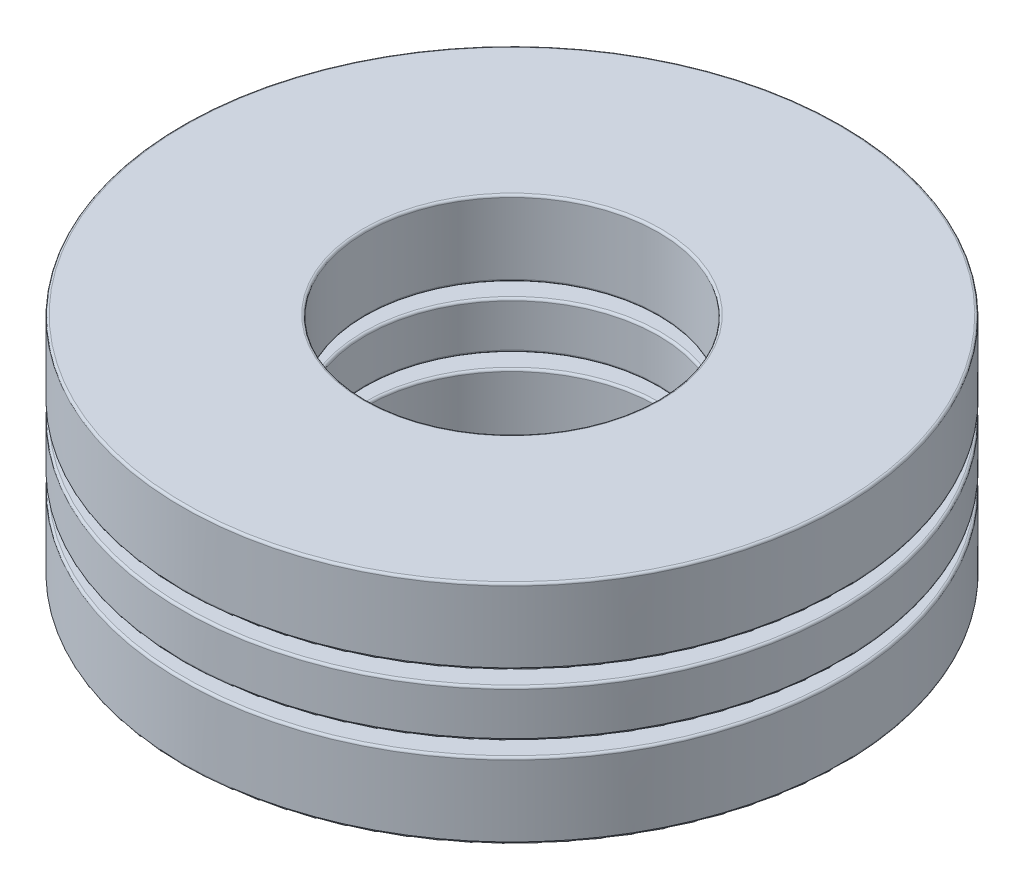
ISO-10303-21;
HEADER;
FILE_DESCRIPTION(('STEP AP214'),'2;1');
FILE_NAME('part.step','',(''),(''),'','','');
FILE_SCHEMA(('AUTOMOTIVE_DESIGN { 1 0 10303 214 1 1 1 1 }'));
ENDSEC;
DATA;
#1=APPLICATION_CONTEXT('core data for automotive mechanical design processes');
#2=APPLICATION_PROTOCOL_DEFINITION('international standard','automotive_design',2000,#1);
#3=PRODUCT_CONTEXT('',#1,'mechanical');
#4=PRODUCT('Part','Part','',(#3));
#5=PRODUCT_RELATED_PRODUCT_CATEGORY('part','',(#4));
#6=PRODUCT_DEFINITION_FORMATION('','',#4);
#7=PRODUCT_DEFINITION_CONTEXT('part definition',#1,'design');
#8=PRODUCT_DEFINITION('design','',#6,#7);
#9=PRODUCT_DEFINITION_SHAPE('','',#8);
#10=(LENGTH_UNIT() NAMED_UNIT(*) SI_UNIT(.MILLI.,.METRE.));
#11=(NAMED_UNIT(*) PLANE_ANGLE_UNIT() SI_UNIT($,.RADIAN.));
#12=(NAMED_UNIT(*) SI_UNIT($,.STERADIAN.) SOLID_ANGLE_UNIT());
#13=UNCERTAINTY_MEASURE_WITH_UNIT(LENGTH_MEASURE(1.E-05),#10,'distance_accuracy_value','');
#14=(GEOMETRIC_REPRESENTATION_CONTEXT(3) GLOBAL_UNCERTAINTY_ASSIGNED_CONTEXT((#13)) GLOBAL_UNIT_ASSIGNED_CONTEXT((#10,
#11,#12)) REPRESENTATION_CONTEXT('',''));
#15=CARTESIAN_POINT('',(0.,0.,0.));
#16=DIRECTION('',(0.,0.,1.));
#17=DIRECTION('',(1.,0.,0.));
#18=AXIS2_PLACEMENT_3D('',#15,#16,#17);
#19=CARTESIAN_POINT('',(0.,-2.4511,0.));
#20=DIRECTION('',(0.,-1.,0.));
#21=DIRECTION('',(0.,0.,-1.));
#22=AXIS2_PLACEMENT_3D('',#19,#20,#21);
#23=CYLINDRICAL_SURFACE('',#22,7.14375);
#24=CARTESIAN_POINT('',(0.,-2.402078,0.));
#25=DIRECTION('',(0.,1.,0.));
#26=DIRECTION('',(0.,0.,1.));
#27=AXIS2_PLACEMENT_3D('',#24,#25,#26);
#28=CIRCLE('',#27,7.14375);
#29=CARTESIAN_POINT('',(0.,-2.402078,7.14375));
#30=VERTEX_POINT('',#29);
#31=EDGE_CURVE('E11',#30,#30,#28,.T.);
#32=ORIENTED_EDGE('',*,*,#31,.T.);
#33=EDGE_LOOP('',(#32));
#34=FACE_BOUND('',#33,.T.);
#35=CARTESIAN_POINT('',(0.,-0.866055333333331,0.));
#36=DIRECTION('',(0.,-1.,0.));
#37=DIRECTION('',(0.,0.,-1.));
#38=AXIS2_PLACEMENT_3D('',#35,#36,#37);
#39=CIRCLE('',#38,7.14375);
#40=CARTESIAN_POINT('',(0.,-0.866055333333331,-7.14375));
#41=VERTEX_POINT('',#40);
#42=EDGE_CURVE('E45',#41,#41,#39,.T.);
#43=ORIENTED_EDGE('',*,*,#42,.T.);
#44=EDGE_LOOP('',(#43));
#45=FACE_BOUND('',#44,.T.);
#46=ADVANCED_FACE('F39',(#34,#45),#23,.T.);
#47=CARTESIAN_POINT('',(0.,-0.817033333333331,7.14375));
#48=DIRECTION('',(0.,-1.,0.));
#49=DIRECTION('',(0.,0.,-1.));
#50=AXIS2_PLACEMENT_3D('',#47,#48,#49);
#51=PLANE('',#50);
#52=CARTESIAN_POINT('',(0.,-0.817033333333331,0.));
#53=DIRECTION('',(0.,-1.,0.));
#54=DIRECTION('',(0.,0.,-1.));
#55=AXIS2_PLACEMENT_3D('',#52,#53,#54);
#56=CIRCLE('',#55,3.224022);
#57=CARTESIAN_POINT('',(0.,-0.817033333333331,-3.224022));
#58=VERTEX_POINT('',#57);
#59=EDGE_CURVE('E49',#58,#58,#56,.T.);
#60=ORIENTED_EDGE('',*,*,#59,.T.);
#61=EDGE_LOOP('',(#60));
#62=FACE_BOUND('',#61,.T.);
#63=CARTESIAN_POINT('',(0.,-0.817033333333331,0.));
#64=DIRECTION('',(0.,-1.,0.));
#65=DIRECTION('',(0.,0.,-1.));
#66=AXIS2_PLACEMENT_3D('',#63,#64,#65);
#67=CIRCLE('',#66,7.094728);
#68=CARTESIAN_POINT('',(0.,-0.817033333333331,-7.094728));
#69=VERTEX_POINT('',#68);
#70=EDGE_CURVE('E53',#69,#69,#67,.F.);
#71=ORIENTED_EDGE('',*,*,#70,.T.);
#72=EDGE_LOOP('',(#71));
#73=FACE_BOUND('',#72,.T.);
#74=ADVANCED_FACE('F81',(#62,#73),#51,.F.);
#75=CARTESIAN_POINT('',(0.,-2.4511,0.));
#76=DIRECTION('',(0.,-1.,0.));
#77=DIRECTION('',(0.,0.,-1.));
#78=AXIS2_PLACEMENT_3D('',#75,#76,#77);
#79=CYLINDRICAL_SURFACE('',#78,3.175);
#80=CARTESIAN_POINT('',(0.,-2.402078,0.));
#81=DIRECTION('',(0.,1.,0.));
#82=DIRECTION('',(0.,0.,1.));
#83=AXIS2_PLACEMENT_3D('',#80,#81,#82);
#84=CIRCLE('',#83,3.175);
#85=CARTESIAN_POINT('',(0.,-2.402078,3.175));
#86=VERTEX_POINT('',#85);
#87=EDGE_CURVE('E64',#86,#86,#84,.F.);
#88=ORIENTED_EDGE('',*,*,#87,.T.);
#89=EDGE_LOOP('',(#88));
#90=FACE_BOUND('',#89,.T.);
#91=CARTESIAN_POINT('',(0.,-0.866055333333331,0.));
#92=DIRECTION('',(0.,-1.,0.));
#93=DIRECTION('',(0.,0.,-1.));
#94=AXIS2_PLACEMENT_3D('',#91,#92,#93);
#95=CIRCLE('',#94,3.175);
#96=CARTESIAN_POINT('',(0.,-0.866055333333331,-3.175));
#97=VERTEX_POINT('',#96);
#98=EDGE_CURVE('E67',#97,#97,#95,.F.);
#99=ORIENTED_EDGE('',*,*,#98,.T.);
#100=EDGE_LOOP('',(#99));
#101=FACE_BOUND('',#100,.T.);
#102=ADVANCED_FACE('F71',(#90,#101),#79,.F.);
#103=CARTESIAN_POINT('',(0.,-2.4511,7.14375));
#104=DIRECTION('',(0.,1.,0.));
#105=DIRECTION('',(0.,0.,1.));
#106=AXIS2_PLACEMENT_3D('',#103,#104,#105);
#107=PLANE('',#106);
#108=CARTESIAN_POINT('',(0.,-2.4511,0.));
#109=DIRECTION('',(0.,1.,0.));
#110=DIRECTION('',(0.,0.,1.));
#111=AXIS2_PLACEMENT_3D('',#108,#109,#110);
#112=CIRCLE('',#111,3.224022);
#113=CARTESIAN_POINT('',(0.,-2.4511,3.224022));
#114=VERTEX_POINT('',#113);
#115=EDGE_CURVE('E58',#114,#114,#112,.T.);
#116=ORIENTED_EDGE('',*,*,#115,.T.);
#117=EDGE_LOOP('',(#116));
#118=FACE_BOUND('',#117,.T.);
#119=CARTESIAN_POINT('',(0.,-2.4511,0.));
#120=DIRECTION('',(0.,1.,0.));
#121=DIRECTION('',(0.,0.,1.));
#122=AXIS2_PLACEMENT_3D('',#119,#120,#121);
#123=CIRCLE('',#122,7.094728);
#124=CARTESIAN_POINT('',(0.,-2.4511,7.094728));
#125=VERTEX_POINT('',#124);
#126=EDGE_CURVE('E61',#125,#125,#123,.F.);
#127=ORIENTED_EDGE('',*,*,#126,.T.);
#128=EDGE_LOOP('',(#127));
#129=FACE_BOUND('',#128,.T.);
#130=ADVANCED_FACE('F108',(#118,#129),#107,.F.);
#131=CARTESIAN_POINT('',(0.,-2.402078,0.));
#132=DIRECTION('',(0.,1.,0.));
#133=DIRECTION('',(0.,0.,1.));
#134=AXIS2_PLACEMENT_3D('',#131,#132,#133);
#135=TOROIDAL_SURFACE('',#134,3.224022,0.049022);
#136=ORIENTED_EDGE('',*,*,#115,.F.);
#137=EDGE_LOOP('',(#136));
#138=FACE_BOUND('',#137,.T.);
#139=ORIENTED_EDGE('',*,*,#87,.F.);
#140=EDGE_LOOP('',(#139));
#141=FACE_BOUND('',#140,.T.);
#142=ADVANCED_FACE('F77',(#138,#141),#135,.T.);
#143=CARTESIAN_POINT('',(0.,-0.866055333333331,0.));
#144=DIRECTION('',(0.,-1.,0.));
#145=DIRECTION('',(0.,0.,-1.));
#146=AXIS2_PLACEMENT_3D('',#143,#144,#145);
#147=TOROIDAL_SURFACE('',#146,3.224022,0.049022);
#148=ORIENTED_EDGE('',*,*,#98,.F.);
#149=EDGE_LOOP('',(#148));
#150=FACE_BOUND('',#149,.T.);
#151=ORIENTED_EDGE('',*,*,#59,.F.);
#152=EDGE_LOOP('',(#151));
#153=FACE_BOUND('',#152,.T.);
#154=ADVANCED_FACE('F73',(#150,#153),#147,.T.);
#155=CARTESIAN_POINT('',(0.,-2.402078,0.));
#156=DIRECTION('',(0.,1.,0.));
#157=DIRECTION('',(0.,0.,1.));
#158=AXIS2_PLACEMENT_3D('',#155,#156,#157);
#159=TOROIDAL_SURFACE('',#158,7.094728,0.049022);
#160=ORIENTED_EDGE('',*,*,#31,.F.);
#161=EDGE_LOOP('',(#160));
#162=FACE_BOUND('',#161,.T.);
#163=ORIENTED_EDGE('',*,*,#126,.F.);
#164=EDGE_LOOP('',(#163));
#165=FACE_BOUND('',#164,.T.);
#166=ADVANCED_FACE('F76',(#162,#165),#159,.T.);
#167=CARTESIAN_POINT('',(0.,-0.866055333333331,0.));
#168=DIRECTION('',(0.,-1.,0.));
#169=DIRECTION('',(0.,0.,-1.));
#170=AXIS2_PLACEMENT_3D('',#167,#168,#169);
#171=TOROIDAL_SURFACE('',#170,7.094728,0.049022);
#172=ORIENTED_EDGE('',*,*,#70,.F.);
#173=EDGE_LOOP('',(#172));
#174=FACE_BOUND('',#173,.T.);
#175=ORIENTED_EDGE('',*,*,#42,.F.);
#176=EDGE_LOOP('',(#175));
#177=FACE_BOUND('',#176,.T.);
#178=ADVANCED_FACE('F86',(#174,#177),#171,.T.);
#179=CLOSED_SHELL('',(#46,#74,#102,#130,#142,#154,#166,#178));
#180=MANIFOLD_SOLID_BREP('B2',#179);
#181=CARTESIAN_POINT('',(0.,-2.4511,0.));
#182=DIRECTION('',(0.,-1.,0.));
#183=DIRECTION('',(0.,0.,-1.));
#184=AXIS2_PLACEMENT_3D('',#181,#182,#183);
#185=CYLINDRICAL_SURFACE('',#184,7.14375);
#186=CARTESIAN_POINT('',(0.,0.866055333333332,0.));
#187=DIRECTION('',(0.,1.,0.));
#188=DIRECTION('',(0.,0.,1.));
#189=AXIS2_PLACEMENT_3D('',#186,#187,#188);
#190=CIRCLE('',#189,7.14375);
#191=CARTESIAN_POINT('',(0.,0.866055333333332,7.14375));
#192=VERTEX_POINT('',#191);
#193=EDGE_CURVE('E38',#192,#192,#190,.T.);
#194=ORIENTED_EDGE('',*,*,#193,.T.);
#195=EDGE_LOOP('',(#194));
#196=FACE_BOUND('',#195,.T.);
#197=CARTESIAN_POINT('',(0.,2.402078,0.));
#198=DIRECTION('',(0.,-1.,0.));
#199=DIRECTION('',(0.,0.,-1.));
#200=AXIS2_PLACEMENT_3D('',#197,#198,#199);
#201=CIRCLE('',#200,7.14375);
#202=CARTESIAN_POINT('',(0.,2.402078,-7.14375));
#203=VERTEX_POINT('',#202);
#204=EDGE_CURVE('E172',#203,#203,#201,.T.);
#205=ORIENTED_EDGE('',*,*,#204,.T.);
#206=EDGE_LOOP('',(#205));
#207=FACE_BOUND('',#206,.T.);
#208=ADVANCED_FACE('F166',(#196,#207),#185,.T.);
#209=CARTESIAN_POINT('',(0.,2.4511,7.14375));
#210=DIRECTION('',(0.,-1.,0.));
#211=DIRECTION('',(0.,0.,-1.));
#212=AXIS2_PLACEMENT_3D('',#209,#210,#211);
#213=PLANE('',#212);
#214=CARTESIAN_POINT('',(0.,2.4511,0.));
#215=DIRECTION('',(0.,-1.,0.));
#216=DIRECTION('',(0.,0.,-1.));
#217=AXIS2_PLACEMENT_3D('',#214,#215,#216);
#218=CIRCLE('',#217,3.224022);
#219=CARTESIAN_POINT('',(0.,2.4511,-3.224022));
#220=VERTEX_POINT('',#219);
#221=EDGE_CURVE('E176',#220,#220,#218,.T.);
#222=ORIENTED_EDGE('',*,*,#221,.T.);
#223=EDGE_LOOP('',(#222));
#224=FACE_BOUND('',#223,.T.);
#225=CARTESIAN_POINT('',(0.,2.4511,0.));
#226=DIRECTION('',(0.,-1.,0.));
#227=DIRECTION('',(0.,0.,-1.));
#228=AXIS2_PLACEMENT_3D('',#225,#226,#227);
#229=CIRCLE('',#228,7.094728);
#230=CARTESIAN_POINT('',(0.,2.4511,-7.094728));
#231=VERTEX_POINT('',#230);
#232=EDGE_CURVE('E180',#231,#231,#229,.F.);
#233=ORIENTED_EDGE('',*,*,#232,.T.);
#234=EDGE_LOOP('',(#233));
#235=FACE_BOUND('',#234,.T.);
#236=ADVANCED_FACE('F208',(#224,#235),#213,.F.);
#237=CARTESIAN_POINT('',(0.,-2.4511,0.));
#238=DIRECTION('',(0.,-1.,0.));
#239=DIRECTION('',(0.,0.,-1.));
#240=AXIS2_PLACEMENT_3D('',#237,#238,#239);
#241=CYLINDRICAL_SURFACE('',#240,3.175);
#242=CARTESIAN_POINT('',(0.,0.866055333333332,0.));
#243=DIRECTION('',(0.,1.,0.));
#244=DIRECTION('',(0.,0.,1.));
#245=AXIS2_PLACEMENT_3D('',#242,#243,#244);
#246=CIRCLE('',#245,3.175);
#247=CARTESIAN_POINT('',(0.,0.866055333333332,3.175));
#248=VERTEX_POINT('',#247);
#249=EDGE_CURVE('E191',#248,#248,#246,.F.);
#250=ORIENTED_EDGE('',*,*,#249,.T.);
#251=EDGE_LOOP('',(#250));
#252=FACE_BOUND('',#251,.T.);
#253=CARTESIAN_POINT('',(0.,2.402078,0.));
#254=DIRECTION('',(0.,-1.,0.));
#255=DIRECTION('',(0.,0.,-1.));
#256=AXIS2_PLACEMENT_3D('',#253,#254,#255);
#257=CIRCLE('',#256,3.175);
#258=CARTESIAN_POINT('',(0.,2.402078,-3.175));
#259=VERTEX_POINT('',#258);
#260=EDGE_CURVE('E194',#259,#259,#257,.F.);
#261=ORIENTED_EDGE('',*,*,#260,.T.);
#262=EDGE_LOOP('',(#261));
#263=FACE_BOUND('',#262,.T.);
#264=ADVANCED_FACE('F198',(#252,#263),#241,.F.);
#265=CARTESIAN_POINT('',(0.,0.817033333333333,7.14375));
#266=DIRECTION('',(0.,1.,0.));
#267=DIRECTION('',(0.,0.,1.));
#268=AXIS2_PLACEMENT_3D('',#265,#266,#267);
#269=PLANE('',#268);
#270=CARTESIAN_POINT('',(0.,0.817033333333333,0.));
#271=DIRECTION('',(0.,1.,0.));
#272=DIRECTION('',(0.,0.,1.));
#273=AXIS2_PLACEMENT_3D('',#270,#271,#272);
#274=CIRCLE('',#273,3.224022);
#275=CARTESIAN_POINT('',(0.,0.817033333333333,3.224022));
#276=VERTEX_POINT('',#275);
#277=EDGE_CURVE('E185',#276,#276,#274,.T.);
#278=ORIENTED_EDGE('',*,*,#277,.T.);
#279=EDGE_LOOP('',(#278));
#280=FACE_BOUND('',#279,.T.);
#281=CARTESIAN_POINT('',(0.,0.817033333333333,0.));
#282=DIRECTION('',(0.,1.,0.));
#283=DIRECTION('',(0.,0.,1.));
#284=AXIS2_PLACEMENT_3D('',#281,#282,#283);
#285=CIRCLE('',#284,7.094728);
#286=CARTESIAN_POINT('',(0.,0.817033333333333,7.094728));
#287=VERTEX_POINT('',#286);
#288=EDGE_CURVE('E188',#287,#287,#285,.F.);
#289=ORIENTED_EDGE('',*,*,#288,.T.);
#290=EDGE_LOOP('',(#289));
#291=FACE_BOUND('',#290,.T.);
#292=ADVANCED_FACE('F235',(#280,#291),#269,.F.);
#293=CARTESIAN_POINT('',(0.,0.866055333333332,0.));
#294=DIRECTION('',(0.,1.,0.));
#295=DIRECTION('',(0.,0.,1.));
#296=AXIS2_PLACEMENT_3D('',#293,#294,#295);
#297=TOROIDAL_SURFACE('',#296,3.224022,0.049022);
#298=ORIENTED_EDGE('',*,*,#277,.F.);
#299=EDGE_LOOP('',(#298));
#300=FACE_BOUND('',#299,.T.);
#301=ORIENTED_EDGE('',*,*,#249,.F.);
#302=EDGE_LOOP('',(#301));
#303=FACE_BOUND('',#302,.T.);
#304=ADVANCED_FACE('F204',(#300,#303),#297,.T.);
#305=CARTESIAN_POINT('',(0.,2.402078,0.));
#306=DIRECTION('',(0.,-1.,0.));
#307=DIRECTION('',(0.,0.,-1.));
#308=AXIS2_PLACEMENT_3D('',#305,#306,#307);
#309=TOROIDAL_SURFACE('',#308,3.224022,0.049022);
#310=ORIENTED_EDGE('',*,*,#260,.F.);
#311=EDGE_LOOP('',(#310));
#312=FACE_BOUND('',#311,.T.);
#313=ORIENTED_EDGE('',*,*,#221,.F.);
#314=EDGE_LOOP('',(#313));
#315=FACE_BOUND('',#314,.T.);
#316=ADVANCED_FACE('F200',(#312,#315),#309,.T.);
#317=CARTESIAN_POINT('',(0.,0.866055333333332,0.));
#318=DIRECTION('',(0.,1.,0.));
#319=DIRECTION('',(0.,0.,1.));
#320=AXIS2_PLACEMENT_3D('',#317,#318,#319);
#321=TOROIDAL_SURFACE('',#320,7.094728,0.049022);
#322=ORIENTED_EDGE('',*,*,#193,.F.);
#323=EDGE_LOOP('',(#322));
#324=FACE_BOUND('',#323,.T.);
#325=ORIENTED_EDGE('',*,*,#288,.F.);
#326=EDGE_LOOP('',(#325));
#327=FACE_BOUND('',#326,.T.);
#328=ADVANCED_FACE('F203',(#324,#327),#321,.T.);
#329=CARTESIAN_POINT('',(0.,2.402078,0.));
#330=DIRECTION('',(0.,-1.,0.));
#331=DIRECTION('',(0.,0.,-1.));
#332=AXIS2_PLACEMENT_3D('',#329,#330,#331);
#333=TOROIDAL_SURFACE('',#332,7.094728,0.049022);
#334=ORIENTED_EDGE('',*,*,#232,.F.);
#335=EDGE_LOOP('',(#334));
#336=FACE_BOUND('',#335,.T.);
#337=ORIENTED_EDGE('',*,*,#204,.F.);
#338=EDGE_LOOP('',(#337));
#339=FACE_BOUND('',#338,.T.);
#340=ADVANCED_FACE('F213',(#336,#339),#333,.T.);
#341=CLOSED_SHELL('',(#208,#236,#264,#292,#304,#316,#328,#340));
#342=MANIFOLD_SOLID_BREP('B6',#341);
#343=CARTESIAN_POINT('',(-4.03376180485845,0.,3.21681769646495));
#344=DIRECTION('',(0.,1.,0.));
#345=DIRECTION('',(0.781831482468022,0.,-0.623489801858743));
#346=AXIS2_PLACEMENT_3D('',#343,#344,#345);
#347=SPHERICAL_SURFACE('',#346,0.817033333333333);
#348=CARTESIAN_POINT('',(-4.03376180485845,0.817033333333333,3.21681769646495));
#349=VERTEX_POINT('',#348);
#350=VERTEX_LOOP('',#349);
#351=FACE_BOUND('',#350,.T.);
#352=ADVANCED_FACE('F293',(#351),#347,.T.);
#353=CLOSED_SHELL('',(#352));
#354=MANIFOLD_SOLID_BREP('B33',#353);
#355=CARTESIAN_POINT('',(-5.03001869691311,0.,-1.14806894363081));
#356=DIRECTION('',(0.,1.,0.));
#357=DIRECTION('',(0.974927912181826,0.,0.222520933956305));
#358=AXIS2_PLACEMENT_3D('',#355,#356,#357);
#359=SPHERICAL_SURFACE('',#358,0.817033333333333);
#360=CARTESIAN_POINT('',(-5.03001869691311,0.817033333333333,-1.14806894363081));
#361=VERTEX_POINT('',#360);
#362=VERTEX_LOOP('',#361);
#363=FACE_BOUND('',#362,.T.);
#364=ADVANCED_FACE('F311',(#363),#359,.T.);
#365=CLOSED_SHELL('',(#364));
#366=MANIFOLD_SOLID_BREP('B162',#365);
#367=CARTESIAN_POINT('',(-2.23856891650969,0.,-4.64843625283403));
#368=DIRECTION('',(0.,1.,0.));
#369=DIRECTION('',(0.433883739117565,0.,0.900968867902416));
#370=AXIS2_PLACEMENT_3D('',#367,#368,#369);
#371=SPHERICAL_SURFACE('',#370,0.817033333333333);
#372=CARTESIAN_POINT('',(-2.23856891650969,0.817033333333333,-4.64843625283403));
#373=VERTEX_POINT('',#372);
#374=VERTEX_LOOP('',#373);
#375=FACE_BOUND('',#374,.T.);
#376=ADVANCED_FACE('F329',(#375),#371,.T.);
#377=CLOSED_SHELL('',(#376));
#378=MANIFOLD_SOLID_BREP('B289',#377);
#379=CARTESIAN_POINT('',(2.23856891650962,0.,-4.64843625283406));
#380=DIRECTION('',(0.,1.,0.));
#381=DIRECTION('',(-0.433883739117553,0.,0.900968867902422));
#382=AXIS2_PLACEMENT_3D('',#379,#380,#381);
#383=SPHERICAL_SURFACE('',#382,0.817033333333333);
#384=CARTESIAN_POINT('',(2.23856891650962,0.817033333333333,-4.64843625283406));
#385=VERTEX_POINT('',#384);
#386=VERTEX_LOOP('',#385);
#387=FACE_BOUND('',#386,.T.);
#388=ADVANCED_FACE('F347',(#387),#383,.T.);
#389=CLOSED_SHELL('',(#388));
#390=MANIFOLD_SOLID_BREP('B307',#389);
#391=CARTESIAN_POINT('',(5.03001869691309,0.,-1.14806894363088));
#392=DIRECTION('',(0.,1.,0.));
#393=DIRECTION('',(-0.974927912181823,0.,0.222520933956318));
#394=AXIS2_PLACEMENT_3D('',#391,#392,#393);
#395=SPHERICAL_SURFACE('',#394,0.817033333333333);
#396=CARTESIAN_POINT('',(5.03001869691309,0.817033333333333,-1.14806894363088));
#397=VERTEX_POINT('',#396);
#398=VERTEX_LOOP('',#397);
#399=FACE_BOUND('',#398,.T.);
#400=ADVANCED_FACE('F365',(#399),#395,.T.);
#401=CLOSED_SHELL('',(#400));
#402=MANIFOLD_SOLID_BREP('B325',#401);
#403=CARTESIAN_POINT('',(4.0337618048585,0.,3.2168176964649));
#404=DIRECTION('',(0.,1.,0.));
#405=DIRECTION('',(-0.781831482468031,0.,-0.623489801858732));
#406=AXIS2_PLACEMENT_3D('',#403,#404,#405);
#407=SPHERICAL_SURFACE('',#406,0.817033333333333);
#408=CARTESIAN_POINT('',(4.0337618048585,0.817033333333333,3.2168176964649));
#409=VERTEX_POINT('',#408);
#410=VERTEX_LOOP('',#409);
#411=FACE_BOUND('',#410,.T.);
#412=ADVANCED_FACE('F383',(#411),#407,.T.);
#413=CLOSED_SHELL('',(#412));
#414=MANIFOLD_SOLID_BREP('B343',#413);
#415=CARTESIAN_POINT('',(0.,0.,5.159375));
#416=DIRECTION('',(0.,1.,0.));
#417=DIRECTION('',(0.,0.,-1.));
#418=AXIS2_PLACEMENT_3D('',#415,#416,#417);
#419=SPHERICAL_SURFACE('',#418,0.817033333333333);
#420=CARTESIAN_POINT('',(0.,0.817033333333333,5.159375));
#421=VERTEX_POINT('',#420);
#422=VERTEX_LOOP('',#421);
#423=FACE_BOUND('',#422,.T.);
#424=ADVANCED_FACE('F402',(#423),#419,.T.);
#425=CLOSED_SHELL('',(#424));
#426=MANIFOLD_SOLID_BREP('B361',#425);
#427=CARTESIAN_POINT('',(0.,-2.4511,0.));
#428=DIRECTION('',(0.,-1.,0.));
#429=DIRECTION('',(0.,0.,-1.));
#430=AXIS2_PLACEMENT_3D('',#427,#428,#429);
#431=CYLINDRICAL_SURFACE('',#430,7.14375);
#432=CARTESIAN_POINT('',(0.,-0.461623833333338,0.));
#433=DIRECTION('',(0.,1.,0.));
#434=DIRECTION('',(0.,0.,1.));
#435=AXIS2_PLACEMENT_3D('',#432,#433,#434);
#436=CIRCLE('',#435,7.14375);
#437=CARTESIAN_POINT('',(0.,-0.461623833333338,7.14375));
#438=VERTEX_POINT('',#437);
#439=EDGE_CURVE('E401',#438,#438,#436,.T.);
#440=ORIENTED_EDGE('',*,*,#439,.T.);
#441=EDGE_LOOP('',(#440));
#442=FACE_BOUND('',#441,.T.);
#443=CARTESIAN_POINT('',(0.,0.461623833333328,0.));
#444=DIRECTION('',(0.,-1.,0.));
#445=DIRECTION('',(0.,0.,-1.));
#446=AXIS2_PLACEMENT_3D('',#443,#444,#445);
#447=CIRCLE('',#446,7.14375);
#448=CARTESIAN_POINT('',(0.,0.461623833333328,-7.14375));
#449=VERTEX_POINT('',#448);
#450=EDGE_CURVE('E420',#449,#449,#447,.T.);
#451=ORIENTED_EDGE('',*,*,#450,.T.);
#452=EDGE_LOOP('',(#451));
#453=FACE_BOUND('',#452,.T.);
#454=ADVANCED_FACE('F414',(#442,#453),#431,.T.);
#455=CARTESIAN_POINT('',(0.,-0.510645833333338,7.14375));
#456=DIRECTION('',(0.,1.,0.));
#457=DIRECTION('',(0.,0.,1.));
#458=AXIS2_PLACEMENT_3D('',#455,#456,#457);
#459=PLANE('',#458);
#460=CARTESIAN_POINT('',(0.,-0.510645833333338,0.));
#461=DIRECTION('',(0.,1.,0.));
#462=DIRECTION('',(0.,0.,1.));
#463=AXIS2_PLACEMENT_3D('',#460,#461,#462);
#464=CIRCLE('',#463,3.224022);
#465=CARTESIAN_POINT('',(0.,-0.510645833333338,3.224022));
#466=VERTEX_POINT('',#465);
#467=EDGE_CURVE('E433',#466,#466,#464,.T.);
#468=ORIENTED_EDGE('',*,*,#467,.T.);
#469=EDGE_LOOP('',(#468));
#470=FACE_BOUND('',#469,.T.);
#471=CARTESIAN_POINT('',(0.,-0.510645833333338,0.));
#472=DIRECTION('',(0.,1.,0.));
#473=DIRECTION('',(0.,0.,1.));
#474=AXIS2_PLACEMENT_3D('',#471,#472,#473);
#475=CIRCLE('',#474,7.094728);
#476=CARTESIAN_POINT('',(0.,-0.510645833333338,7.094728));
#477=VERTEX_POINT('',#476);
#478=EDGE_CURVE('E436',#477,#477,#475,.F.);
#479=ORIENTED_EDGE('',*,*,#478,.T.);
#480=EDGE_LOOP('',(#479));
#481=FACE_BOUND('',#480,.T.);
#482=CARTESIAN_POINT('',(-4.03376180485845,-0.510645833333338,3.21681769646495));
#483=DIRECTION('',(0.,1.,0.));
#484=DIRECTION('',(-0.781831482468022,0.,0.623489801858743));
#485=AXIS2_PLACEMENT_3D('',#482,#483,#484);
#486=CIRCLE('',#485,0.637796441411426);
#487=CARTESIAN_POINT('',(-4.53241114215998,-0.510645833333338,3.61447727334677));
#488=VERTEX_POINT('',#487);
#489=EDGE_CURVE('E481',#488,#488,#486,.T.);
#490=ORIENTED_EDGE('',*,*,#489,.T.);
#491=EDGE_LOOP('',(#490));
#492=FACE_BOUND('',#491,.T.);
#493=CARTESIAN_POINT('',(-5.03001869691311,-0.510645833333338,-1.14806894363081));
#494=DIRECTION('',(0.,1.,0.));
#495=DIRECTION('',(-0.974927912181826,0.,-0.222520933956305));
#496=AXIS2_PLACEMENT_3D('',#493,#494,#495);
#497=CIRCLE('',#496,0.637796441411426);
#498=CARTESIAN_POINT('',(-5.65182424993535,-0.510645833333338,-1.28999200344769));
#499=VERTEX_POINT('',#498);
#500=EDGE_CURVE('E475',#499,#499,#497,.T.);
#501=ORIENTED_EDGE('',*,*,#500,.T.);
#502=EDGE_LOOP('',(#501));
#503=FACE_BOUND('',#502,.T.);
#504=CARTESIAN_POINT('',(-2.23856891650969,-0.510645833333338,-4.64843625283403));
#505=DIRECTION('',(0.,1.,0.));
#506=DIRECTION('',(-0.433883739117565,0.,-0.900968867902416));
#507=AXIS2_PLACEMENT_3D('',#504,#505,#506);
#508=CIRCLE('',#507,0.637796441411426);
#509=CARTESIAN_POINT('',(-2.51529842130515,-0.510645833333338,-5.22307099060467));
#510=VERTEX_POINT('',#509);
#511=EDGE_CURVE('E469',#510,#510,#508,.T.);
#512=ORIENTED_EDGE('',*,*,#511,.T.);
#513=EDGE_LOOP('',(#512));
#514=FACE_BOUND('',#513,.T.);
#515=CARTESIAN_POINT('',(2.23856891650962,-0.510645833333338,-4.64843625283406));
#516=DIRECTION('',(0.,1.,0.));
#517=DIRECTION('',(0.433883739117553,0.,-0.900968867902422));
#518=AXIS2_PLACEMENT_3D('',#515,#516,#517);
#519=CIRCLE('',#518,0.637796441411426);
#520=CARTESIAN_POINT('',(2.51529842130508,-0.510645833333338,-5.2230709906047));
#521=VERTEX_POINT('',#520);
#522=EDGE_CURVE('E463',#521,#521,#519,.T.);
#523=ORIENTED_EDGE('',*,*,#522,.T.);
#524=EDGE_LOOP('',(#523));
#525=FACE_BOUND('',#524,.T.);
#526=CARTESIAN_POINT('',(5.03001869691309,-0.510645833333338,-1.14806894363088));
#527=DIRECTION('',(0.,1.,0.));
#528=DIRECTION('',(0.974927912181823,0.,-0.222520933956318));
#529=AXIS2_PLACEMENT_3D('',#526,#527,#528);
#530=CIRCLE('',#529,0.637796441411426);
#531=CARTESIAN_POINT('',(5.65182424993533,-0.510645833333338,-1.28999200344777));
#532=VERTEX_POINT('',#531);
#533=EDGE_CURVE('E457',#532,#532,#530,.T.);
#534=ORIENTED_EDGE('',*,*,#533,.T.);
#535=EDGE_LOOP('',(#534));
#536=FACE_BOUND('',#535,.T.);
#537=CARTESIAN_POINT('',(4.0337618048585,-0.510645833333338,3.2168176964649));
#538=DIRECTION('',(0.,1.,0.));
#539=DIRECTION('',(0.781831482468031,0.,0.623489801858732));
#540=AXIS2_PLACEMENT_3D('',#537,#538,#539);
#541=CIRCLE('',#540,0.637796441411426);
#542=CARTESIAN_POINT('',(4.53241114216003,-0.510645833333338,3.61447727334671));
#543=VERTEX_POINT('',#542);
#544=EDGE_CURVE('E449',#543,#543,#541,.T.);
#545=ORIENTED_EDGE('',*,*,#544,.T.);
#546=EDGE_LOOP('',(#545));
#547=FACE_BOUND('',#546,.T.);
#548=CARTESIAN_POINT('',(0.,-0.510645833333338,5.159375));
#549=DIRECTION('',(0.,1.,0.));
#550=DIRECTION('',(0.,0.,1.));
#551=AXIS2_PLACEMENT_3D('',#548,#549,#550);
#552=CIRCLE('',#551,0.637796441411426);
#553=CARTESIAN_POINT('',(0.,-0.510645833333338,5.79717144141143));
#554=VERTEX_POINT('',#553);
#555=EDGE_CURVE('E445',#554,#554,#552,.T.);
#556=ORIENTED_EDGE('',*,*,#555,.T.);
#557=EDGE_LOOP('',(#556));
#558=FACE_BOUND('',#557,.T.);
#559=ADVANCED_FACE('F499',(#470,#481,#492,#503,#514,#525,#536,#547,#558),#459,.F.);
#560=CARTESIAN_POINT('',(0.,-2.4511,0.));
#561=DIRECTION('',(0.,-1.,0.));
#562=DIRECTION('',(0.,0.,-1.));
#563=AXIS2_PLACEMENT_3D('',#560,#561,#562);
#564=CYLINDRICAL_SURFACE('',#563,3.175);
#565=CARTESIAN_POINT('',(0.,-0.461623833333338,0.));
#566=DIRECTION('',(0.,1.,0.));
#567=DIRECTION('',(0.,0.,1.));
#568=AXIS2_PLACEMENT_3D('',#565,#566,#567);
#569=CIRCLE('',#568,3.175);
#570=CARTESIAN_POINT('',(0.,-0.461623833333338,3.175));
#571=VERTEX_POINT('',#570);
#572=EDGE_CURVE('E439',#571,#571,#569,.F.);
#573=ORIENTED_EDGE('',*,*,#572,.T.);
#574=EDGE_LOOP('',(#573));
#575=FACE_BOUND('',#574,.T.);
#576=CARTESIAN_POINT('',(0.,0.461623833333328,0.));
#577=DIRECTION('',(0.,-1.,0.));
#578=DIRECTION('',(0.,0.,-1.));
#579=AXIS2_PLACEMENT_3D('',#576,#577,#578);
#580=CIRCLE('',#579,3.175);
#581=CARTESIAN_POINT('',(0.,0.461623833333328,-3.175));
#582=VERTEX_POINT('',#581);
#583=EDGE_CURVE('E442',#582,#582,#580,.F.);
#584=ORIENTED_EDGE('',*,*,#583,.T.);
#585=EDGE_LOOP('',(#584));
#586=FACE_BOUND('',#585,.T.);
#587=ADVANCED_FACE('F502',(#575,#586),#564,.F.);
#588=CARTESIAN_POINT('',(0.,0.510645833333328,7.14375));
#589=DIRECTION('',(0.,-1.,0.));
#590=DIRECTION('',(0.,0.,-1.));
#591=AXIS2_PLACEMENT_3D('',#588,#589,#590);
#592=PLANE('',#591);
#593=CARTESIAN_POINT('',(0.,0.510645833333328,0.));
#594=DIRECTION('',(0.,-1.,0.));
#595=DIRECTION('',(0.,0.,-1.));
#596=AXIS2_PLACEMENT_3D('',#593,#594,#595);
#597=CIRCLE('',#596,3.224022);
#598=CARTESIAN_POINT('',(0.,0.510645833333328,-3.224022));
#599=VERTEX_POINT('',#598);
#600=EDGE_CURVE('E424',#599,#599,#597,.T.);
#601=ORIENTED_EDGE('',*,*,#600,.T.);
#602=EDGE_LOOP('',(#601));
#603=FACE_BOUND('',#602,.T.);
#604=CARTESIAN_POINT('',(0.,0.510645833333328,0.));
#605=DIRECTION('',(0.,-1.,0.));
#606=DIRECTION('',(0.,0.,-1.));
#607=AXIS2_PLACEMENT_3D('',#604,#605,#606);
#608=CIRCLE('',#607,7.094728);
#609=CARTESIAN_POINT('',(0.,0.510645833333328,-7.094728));
#610=VERTEX_POINT('',#609);
#611=EDGE_CURVE('E428',#610,#610,#608,.F.);
#612=ORIENTED_EDGE('',*,*,#611,.T.);
#613=EDGE_LOOP('',(#612));
#614=FACE_BOUND('',#613,.T.);
#615=CARTESIAN_POINT('',(-4.03376180485845,0.510645833333328,3.21681769646495));
#616=DIRECTION('',(0.,-1.,0.));
#617=DIRECTION('',(0.781831482468022,0.,-0.623489801858743));
#618=AXIS2_PLACEMENT_3D('',#615,#616,#617);
#619=CIRCLE('',#618,0.637796441411434);
#620=CARTESIAN_POINT('',(-3.53511246755692,0.510645833333328,2.81915811958313));
#621=VERTEX_POINT('',#620);
#622=EDGE_CURVE('E484',#621,#621,#619,.T.);
#623=ORIENTED_EDGE('',*,*,#622,.T.);
#624=EDGE_LOOP('',(#623));
#625=FACE_BOUND('',#624,.T.);
#626=CARTESIAN_POINT('',(-5.03001869691311,0.510645833333328,-1.14806894363081));
#627=DIRECTION('',(0.,-1.,0.));
#628=DIRECTION('',(0.974927912181826,0.,0.222520933956305));
#629=AXIS2_PLACEMENT_3D('',#626,#627,#628);
#630=CIRCLE('',#629,0.637796441411434);
#631=CARTESIAN_POINT('',(-4.40821314389086,0.510645833333328,-1.00614588381393));
#632=VERTEX_POINT('',#631);
#633=EDGE_CURVE('E478',#632,#632,#630,.T.);
#634=ORIENTED_EDGE('',*,*,#633,.T.);
#635=EDGE_LOOP('',(#634));
#636=FACE_BOUND('',#635,.T.);
#637=CARTESIAN_POINT('',(-2.23856891650969,0.510645833333328,-4.64843625283403));
#638=DIRECTION('',(0.,-1.,0.));
#639=DIRECTION('',(0.433883739117565,0.,0.900968867902416));
#640=AXIS2_PLACEMENT_3D('',#637,#638,#639);
#641=CIRCLE('',#640,0.637796441411434);
#642=CARTESIAN_POINT('',(-1.96183941171422,0.510645833333328,-4.07380151506338));
#643=VERTEX_POINT('',#642);
#644=EDGE_CURVE('E472',#643,#643,#641,.T.);
#645=ORIENTED_EDGE('',*,*,#644,.T.);
#646=EDGE_LOOP('',(#645));
#647=FACE_BOUND('',#646,.T.);
#648=CARTESIAN_POINT('',(2.23856891650962,0.510645833333328,-4.64843625283406));
#649=DIRECTION('',(0.,-1.,0.));
#650=DIRECTION('',(-0.433883739117553,0.,0.900968867902422));
#651=AXIS2_PLACEMENT_3D('',#648,#649,#650);
#652=CIRCLE('',#651,0.637796441411434);
#653=CARTESIAN_POINT('',(1.96183941171416,0.510645833333328,-4.07380151506341));
#654=VERTEX_POINT('',#653);
#655=EDGE_CURVE('E466',#654,#654,#652,.T.);
#656=ORIENTED_EDGE('',*,*,#655,.T.);
#657=EDGE_LOOP('',(#656));
#658=FACE_BOUND('',#657,.T.);
#659=CARTESIAN_POINT('',(5.03001869691309,0.510645833333328,-1.14806894363088));
#660=DIRECTION('',(0.,-1.,0.));
#661=DIRECTION('',(-0.974927912181823,0.,0.222520933956318));
#662=AXIS2_PLACEMENT_3D('',#659,#660,#661);
#663=CIRCLE('',#662,0.637796441411434);
#664=CARTESIAN_POINT('',(4.40821314389085,0.510645833333328,-1.00614588381399));
#665=VERTEX_POINT('',#664);
#666=EDGE_CURVE('E460',#665,#665,#663,.T.);
#667=ORIENTED_EDGE('',*,*,#666,.T.);
#668=EDGE_LOOP('',(#667));
#669=FACE_BOUND('',#668,.T.);
#670=CARTESIAN_POINT('',(4.0337618048585,0.510645833333328,3.2168176964649));
#671=DIRECTION('',(0.,-1.,0.));
#672=DIRECTION('',(-0.781831482468031,0.,-0.623489801858732));
#673=AXIS2_PLACEMENT_3D('',#670,#671,#672);
#674=CIRCLE('',#673,0.637796441411434);
#675=CARTESIAN_POINT('',(3.53511246755696,0.510645833333328,2.81915811958308));
#676=VERTEX_POINT('',#675);
#677=EDGE_CURVE('E454',#676,#676,#674,.T.);
#678=ORIENTED_EDGE('',*,*,#677,.T.);
#679=EDGE_LOOP('',(#678));
#680=FACE_BOUND('',#679,.T.);
#681=CARTESIAN_POINT('',(0.,0.510645833333328,5.159375));
#682=DIRECTION('',(0.,-1.,0.));
#683=DIRECTION('',(0.,0.,-1.));
#684=AXIS2_PLACEMENT_3D('',#681,#682,#683);
#685=CIRCLE('',#684,0.637796441411434);
#686=CARTESIAN_POINT('',(0.,0.510645833333328,4.52157855858857));
#687=VERTEX_POINT('',#686);
#688=EDGE_CURVE('E446',#687,#687,#685,.T.);
#689=ORIENTED_EDGE('',*,*,#688,.T.);
#690=EDGE_LOOP('',(#689));
#691=FACE_BOUND('',#690,.T.);
#692=ADVANCED_FACE('F488',(#603,#614,#625,#636,#647,#658,#669,#680,#691),#592,.F.);
#693=CARTESIAN_POINT('',(0.,0.,5.159375));
#694=DIRECTION('',(0.,1.,0.));
#695=DIRECTION('',(0.,0.,-1.));
#696=AXIS2_PLACEMENT_3D('',#693,#694,#695);
#697=SPHERICAL_SURFACE('',#696,0.817033333333333);
#698=ORIENTED_EDGE('',*,*,#688,.F.);
#699=EDGE_LOOP('',(#698));
#700=FACE_BOUND('',#699,.T.);
#701=ORIENTED_EDGE('',*,*,#555,.F.);
#702=EDGE_LOOP('',(#701));
#703=FACE_BOUND('',#702,.T.);
#704=ADVANCED_FACE('F516',(#700,#703),#697,.F.);
#705=CARTESIAN_POINT('',(4.0337618048585,0.,3.2168176964649));
#706=DIRECTION('',(0.,1.,0.));
#707=DIRECTION('',(-0.781831482468031,0.,-0.623489801858732));
#708=AXIS2_PLACEMENT_3D('',#705,#706,#707);
#709=SPHERICAL_SURFACE('',#708,0.817033333333333);
#710=ORIENTED_EDGE('',*,*,#677,.F.);
#711=EDGE_LOOP('',(#710));
#712=FACE_BOUND('',#711,.T.);
#713=ORIENTED_EDGE('',*,*,#544,.F.);
#714=EDGE_LOOP('',(#713));
#715=FACE_BOUND('',#714,.T.);
#716=ADVANCED_FACE('F518',(#712,#715),#709,.F.);
#717=CARTESIAN_POINT('',(5.03001869691309,0.,-1.14806894363088));
#718=DIRECTION('',(0.,1.,0.));
#719=DIRECTION('',(-0.974927912181823,0.,0.222520933956318));
#720=AXIS2_PLACEMENT_3D('',#717,#718,#719);
#721=SPHERICAL_SURFACE('',#720,0.817033333333333);
#722=ORIENTED_EDGE('',*,*,#666,.F.);
#723=EDGE_LOOP('',(#722));
#724=FACE_BOUND('',#723,.T.);
#725=ORIENTED_EDGE('',*,*,#533,.F.);
#726=EDGE_LOOP('',(#725));
#727=FACE_BOUND('',#726,.T.);
#728=ADVANCED_FACE('F525',(#724,#727),#721,.F.);
#729=CARTESIAN_POINT('',(2.23856891650962,0.,-4.64843625283406));
#730=DIRECTION('',(0.,1.,0.));
#731=DIRECTION('',(-0.433883739117553,0.,0.900968867902422));
#732=AXIS2_PLACEMENT_3D('',#729,#730,#731);
#733=SPHERICAL_SURFACE('',#732,0.817033333333333);
#734=ORIENTED_EDGE('',*,*,#655,.F.);
#735=EDGE_LOOP('',(#734));
#736=FACE_BOUND('',#735,.T.);
#737=ORIENTED_EDGE('',*,*,#522,.F.);
#738=EDGE_LOOP('',(#737));
#739=FACE_BOUND('',#738,.T.);
#740=ADVANCED_FACE('F604',(#736,#739),#733,.F.);
#741=CARTESIAN_POINT('',(-2.23856891650969,0.,-4.64843625283403));
#742=DIRECTION('',(0.,1.,0.));
#743=DIRECTION('',(0.433883739117565,0.,0.900968867902416));
#744=AXIS2_PLACEMENT_3D('',#741,#742,#743);
#745=SPHERICAL_SURFACE('',#744,0.817033333333333);
#746=ORIENTED_EDGE('',*,*,#644,.F.);
#747=EDGE_LOOP('',(#746));
#748=FACE_BOUND('',#747,.T.);
#749=ORIENTED_EDGE('',*,*,#511,.F.);
#750=EDGE_LOOP('',(#749));
#751=FACE_BOUND('',#750,.T.);
#752=ADVANCED_FACE('F600',(#748,#751),#745,.F.);
#753=CARTESIAN_POINT('',(-5.03001869691311,0.,-1.14806894363081));
#754=DIRECTION('',(0.,1.,0.));
#755=DIRECTION('',(0.974927912181826,0.,0.222520933956305));
#756=AXIS2_PLACEMENT_3D('',#753,#754,#755);
#757=SPHERICAL_SURFACE('',#756,0.817033333333333);
#758=ORIENTED_EDGE('',*,*,#633,.F.);
#759=EDGE_LOOP('',(#758));
#760=FACE_BOUND('',#759,.T.);
#761=ORIENTED_EDGE('',*,*,#500,.F.);
#762=EDGE_LOOP('',(#761));
#763=FACE_BOUND('',#762,.T.);
#764=ADVANCED_FACE('F495',(#760,#763),#757,.F.);
#765=CARTESIAN_POINT('',(-4.03376180485845,0.,3.21681769646495));
#766=DIRECTION('',(0.,1.,0.));
#767=DIRECTION('',(0.781831482468022,0.,-0.623489801858743));
#768=AXIS2_PLACEMENT_3D('',#765,#766,#767);
#769=SPHERICAL_SURFACE('',#768,0.817033333333333);
#770=ORIENTED_EDGE('',*,*,#622,.F.);
#771=EDGE_LOOP('',(#770));
#772=FACE_BOUND('',#771,.T.);
#773=ORIENTED_EDGE('',*,*,#489,.F.);
#774=EDGE_LOOP('',(#773));
#775=FACE_BOUND('',#774,.T.);
#776=ADVANCED_FACE('F491',(#772,#775),#769,.F.);
#777=CARTESIAN_POINT('',(0.,-0.461623833333338,0.));
#778=DIRECTION('',(0.,1.,0.));
#779=DIRECTION('',(0.,0.,1.));
#780=AXIS2_PLACEMENT_3D('',#777,#778,#779);
#781=TOROIDAL_SURFACE('',#780,3.224022,0.049022);
#782=ORIENTED_EDGE('',*,*,#467,.F.);
#783=EDGE_LOOP('',(#782));
#784=FACE_BOUND('',#783,.T.);
#785=ORIENTED_EDGE('',*,*,#572,.F.);
#786=EDGE_LOOP('',(#785));
#787=FACE_BOUND('',#786,.T.);
#788=ADVANCED_FACE('F494',(#784,#787),#781,.T.);
#789=CARTESIAN_POINT('',(0.,0.461623833333328,0.));
#790=DIRECTION('',(0.,-1.,0.));
#791=DIRECTION('',(0.,0.,-1.));
#792=AXIS2_PLACEMENT_3D('',#789,#790,#791);
#793=TOROIDAL_SURFACE('',#792,3.224022,0.049022);
#794=ORIENTED_EDGE('',*,*,#583,.F.);
#795=EDGE_LOOP('',(#794));
#796=FACE_BOUND('',#795,.T.);
#797=ORIENTED_EDGE('',*,*,#600,.F.);
#798=EDGE_LOOP('',(#797));
#799=FACE_BOUND('',#798,.T.);
#800=ADVANCED_FACE('F560',(#796,#799),#793,.T.);
#801=CARTESIAN_POINT('',(0.,-0.461623833333338,0.));
#802=DIRECTION('',(0.,1.,0.));
#803=DIRECTION('',(0.,0.,1.));
#804=AXIS2_PLACEMENT_3D('',#801,#802,#803);
#805=TOROIDAL_SURFACE('',#804,7.094728,0.049022);
#806=ORIENTED_EDGE('',*,*,#439,.F.);
#807=EDGE_LOOP('',(#806));
#808=FACE_BOUND('',#807,.T.);
#809=ORIENTED_EDGE('',*,*,#478,.F.);
#810=EDGE_LOOP('',(#809));
#811=FACE_BOUND('',#810,.T.);
#812=ADVANCED_FACE('F571',(#808,#811),#805,.T.);
#813=CARTESIAN_POINT('',(0.,0.461623833333328,0.));
#814=DIRECTION('',(0.,-1.,0.));
#815=DIRECTION('',(0.,0.,-1.));
#816=AXIS2_PLACEMENT_3D('',#813,#814,#815);
#817=TOROIDAL_SURFACE('',#816,7.094728,0.049022);
#818=ORIENTED_EDGE('',*,*,#611,.F.);
#819=EDGE_LOOP('',(#818));
#820=FACE_BOUND('',#819,.T.);
#821=ORIENTED_EDGE('',*,*,#450,.F.);
#822=EDGE_LOOP('',(#821));
#823=FACE_BOUND('',#822,.T.);
#824=ADVANCED_FACE('F581',(#820,#823),#817,.T.);
#825=CLOSED_SHELL('',(#454,#559,#587,#692,#704,#716,#728,#740,#752,#764,#776,#788,#800,#812,#824));
#826=MANIFOLD_SOLID_BREP('B379',#825);
#827=ADVANCED_BREP_SHAPE_REPRESENTATION('',(#18,#180,#342,#354,#366,#378,#390,#402,#414,#426,
#826),#14);
#828=SHAPE_DEFINITION_REPRESENTATION(#9,#827);
ENDSEC;
END-ISO-10303-21;
